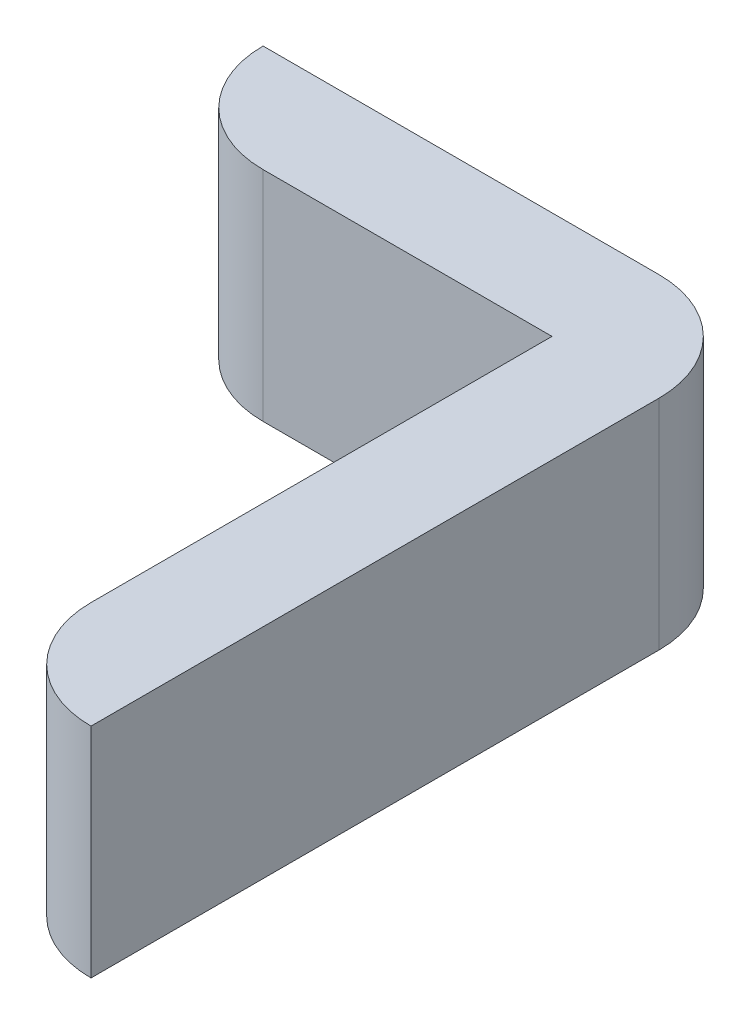
ISO-10303-21;
HEADER;
FILE_DESCRIPTION(('STEP AP214'),'2;1');
FILE_NAME('part.step','',(''),(''),'','','');
FILE_SCHEMA(('AUTOMOTIVE_DESIGN { 1 0 10303 214 1 1 1 1 }'));
ENDSEC;
DATA;
#1=APPLICATION_CONTEXT('core data for automotive mechanical design processes');
#2=APPLICATION_PROTOCOL_DEFINITION('international standard','automotive_design',2000,#1);
#3=PRODUCT_CONTEXT('',#1,'mechanical');
#4=PRODUCT('Part','Part','',(#3));
#5=PRODUCT_RELATED_PRODUCT_CATEGORY('part','',(#4));
#6=PRODUCT_DEFINITION_FORMATION('','',#4);
#7=PRODUCT_DEFINITION_CONTEXT('part definition',#1,'design');
#8=PRODUCT_DEFINITION('design','',#6,#7);
#9=PRODUCT_DEFINITION_SHAPE('','',#8);
#10=(LENGTH_UNIT() NAMED_UNIT(*) SI_UNIT(.MILLI.,.METRE.));
#11=(NAMED_UNIT(*) PLANE_ANGLE_UNIT() SI_UNIT($,.RADIAN.));
#12=(NAMED_UNIT(*) SI_UNIT($,.STERADIAN.) SOLID_ANGLE_UNIT());
#13=UNCERTAINTY_MEASURE_WITH_UNIT(LENGTH_MEASURE(1.E-05),#10,'distance_accuracy_value','');
#14=(GEOMETRIC_REPRESENTATION_CONTEXT(3) GLOBAL_UNCERTAINTY_ASSIGNED_CONTEXT((#13)) GLOBAL_UNIT_ASSIGNED_CONTEXT((#10,
#11,#12)) REPRESENTATION_CONTEXT('',''));
#15=CARTESIAN_POINT('',(0.,0.,0.));
#16=DIRECTION('',(0.,0.,1.));
#17=DIRECTION('',(1.,0.,0.));
#18=AXIS2_PLACEMENT_3D('',#15,#16,#17);
#19=CARTESIAN_POINT('',(-0.125,4.0648,0.));
#20=DIRECTION('',(0.,-1.,0.));
#21=DIRECTION('',(0.,0.,-1.));
#22=AXIS2_PLACEMENT_3D('',#19,#20,#21);
#23=PLANE('',#22);
#24=DIRECTION('',(-1.,0.,0.));
#25=VECTOR('',#24,1.);
#26=CARTESIAN_POINT('',(0.125,4.0648,0.25));
#27=LINE('',#26,#25);
#28=CARTESIAN_POINT('',(0.125,4.0648,0.25));
#29=VERTEX_POINT('',#28);
#30=CARTESIAN_POINT('',(0.8,4.0648,0.25));
#31=VERTEX_POINT('',#30);
#32=EDGE_CURVE('E102',#29,#31,#27,.F.);
#33=ORIENTED_EDGE('',*,*,#32,.T.);
#34=DIRECTION('',(0.,0.,-1.));
#35=VECTOR('',#34,1.);
#36=CARTESIAN_POINT('',(0.8,4.0648,0.25));
#37=LINE('',#36,#35);
#38=CARTESIAN_POINT('',(0.8,4.0648,1.327));
#39=VERTEX_POINT('',#38);
#40=EDGE_CURVE('E108',#31,#39,#37,.F.);
#41=ORIENTED_EDGE('',*,*,#40,.T.);
#42=CARTESIAN_POINT('',(1.05,4.0648,1.327));
#43=DIRECTION('',(0.,-1.,0.));
#44=DIRECTION('',(0.,0.,-1.));
#45=AXIS2_PLACEMENT_3D('',#42,#43,#44);
#46=CIRCLE('',#45,0.25);
#47=CARTESIAN_POINT('',(1.05,4.0648,1.577));
#48=VERTEX_POINT('',#47);
#49=EDGE_CURVE('E80',#48,#39,#46,.T.);
#50=ORIENTED_EDGE('',*,*,#49,.F.);
#51=DIRECTION('',(0.,0.,1.));
#52=VECTOR('',#51,1.);
#53=CARTESIAN_POINT('',(1.05,4.0648,1.577));
#54=LINE('',#53,#52);
#55=CARTESIAN_POINT('',(1.05,4.0648,0.25));
#56=VERTEX_POINT('',#55);
#57=EDGE_CURVE('E75',#48,#56,#54,.F.);
#58=ORIENTED_EDGE('',*,*,#57,.T.);
#59=CARTESIAN_POINT('',(0.8,4.0648,0.25));
#60=DIRECTION('',(0.,-1.,0.));
#61=DIRECTION('',(0.,0.,-1.));
#62=AXIS2_PLACEMENT_3D('',#59,#60,#61);
#63=CIRCLE('',#62,0.25);
#64=CARTESIAN_POINT('',(0.8,4.0648,0.));
#65=VERTEX_POINT('',#64);
#66=EDGE_CURVE('E19',#65,#56,#63,.T.);
#67=ORIENTED_EDGE('',*,*,#66,.F.);
#68=DIRECTION('',(1.,0.,0.));
#69=VECTOR('',#68,1.);
#70=CARTESIAN_POINT('',(0.8,4.0648,0.));
#71=LINE('',#70,#69);
#72=CARTESIAN_POINT('',(-0.125,4.0648,0.));
#73=VERTEX_POINT('',#72);
#74=EDGE_CURVE('E70',#65,#73,#71,.F.);
#75=ORIENTED_EDGE('',*,*,#74,.T.);
#76=CARTESIAN_POINT('',(0.125,4.0648,0.));
#77=DIRECTION('',(0.,-1.,0.));
#78=DIRECTION('',(0.,0.,-1.));
#79=AXIS2_PLACEMENT_3D('',#76,#77,#78);
#80=CIRCLE('',#79,0.25);
#81=EDGE_CURVE('E121',#29,#73,#80,.T.);
#82=ORIENTED_EDGE('',*,*,#81,.F.);
#83=EDGE_LOOP('',(#33,#41,#50,#58,#67,#75,#82));
#84=FACE_BOUND('',#83,.T.);
#85=ADVANCED_FACE('F16',(#84),#23,.F.);
#86=CARTESIAN_POINT('',(0.8,3.5552,0.));
#87=DIRECTION('',(0.,0.,1.));
#88=DIRECTION('',(1.,0.,0.));
#89=AXIS2_PLACEMENT_3D('',#86,#87,#88);
#90=PLANE('',#89);
#91=DIRECTION('',(0.,-1.,0.));
#92=VECTOR('',#91,1.);
#93=CARTESIAN_POINT('',(-0.125,3.5552,0.));
#94=LINE('',#93,#92);
#95=CARTESIAN_POINT('',(-0.125,3.5552,0.));
#96=VERTEX_POINT('',#95);
#97=EDGE_CURVE('E123',#73,#96,#94,.T.);
#98=ORIENTED_EDGE('',*,*,#97,.F.);
#99=ORIENTED_EDGE('',*,*,#74,.F.);
#100=DIRECTION('',(0.,-1.,0.));
#101=VECTOR('',#100,1.);
#102=CARTESIAN_POINT('',(0.8,3.5552,0.));
#103=LINE('',#102,#101);
#104=CARTESIAN_POINT('',(0.8,3.5552,0.));
#105=VERTEX_POINT('',#104);
#106=EDGE_CURVE('E92',#105,#65,#103,.F.);
#107=ORIENTED_EDGE('',*,*,#106,.F.);
#108=DIRECTION('',(1.,0.,0.));
#109=VECTOR('',#108,1.);
#110=CARTESIAN_POINT('',(-0.125,3.5552,0.));
#111=LINE('',#110,#109);
#112=EDGE_CURVE('E120',#96,#105,#111,.T.);
#113=ORIENTED_EDGE('',*,*,#112,.F.);
#114=EDGE_LOOP('',(#98,#99,#107,#113));
#115=FACE_BOUND('',#114,.T.);
#116=ADVANCED_FACE('F158',(#115),#90,.F.);
#117=CARTESIAN_POINT('',(0.8,3.5552,0.25));
#118=DIRECTION('',(0.,-1.,0.));
#119=DIRECTION('',(0.,0.,-1.));
#120=AXIS2_PLACEMENT_3D('',#117,#118,#119);
#121=CYLINDRICAL_SURFACE('',#120,0.25);
#122=ORIENTED_EDGE('',*,*,#66,.T.);
#123=DIRECTION('',(0.,1.,0.));
#124=VECTOR('',#123,1.);
#125=CARTESIAN_POINT('',(1.05,3.5552,0.25));
#126=LINE('',#125,#124);
#127=CARTESIAN_POINT('',(1.05,3.5552,0.25));
#128=VERTEX_POINT('',#127);
#129=EDGE_CURVE('E86',#56,#128,#126,.F.);
#130=ORIENTED_EDGE('',*,*,#129,.T.);
#131=CARTESIAN_POINT('',(0.8,3.5552,0.25));
#132=DIRECTION('',(0.,-1.,0.));
#133=DIRECTION('',(0.,0.,-1.));
#134=AXIS2_PLACEMENT_3D('',#131,#132,#133);
#135=CIRCLE('',#134,0.25);
#136=EDGE_CURVE('E118',#105,#128,#135,.T.);
#137=ORIENTED_EDGE('',*,*,#136,.F.);
#138=ORIENTED_EDGE('',*,*,#106,.T.);
#139=EDGE_LOOP('',(#122,#130,#137,#138));
#140=FACE_BOUND('',#139,.T.);
#141=ADVANCED_FACE('F89',(#140),#121,.T.);
#142=CARTESIAN_POINT('',(1.05,3.5552,1.577));
#143=DIRECTION('',(-1.,0.,0.));
#144=DIRECTION('',(0.,0.,1.));
#145=AXIS2_PLACEMENT_3D('',#142,#143,#144);
#146=PLANE('',#145);
#147=DIRECTION('',(0.,-1.,0.));
#148=VECTOR('',#147,1.);
#149=CARTESIAN_POINT('',(1.05,3.5552,1.577));
#150=LINE('',#149,#148);
#151=CARTESIAN_POINT('',(1.05,3.5552,1.577));
#152=VERTEX_POINT('',#151);
#153=EDGE_CURVE('E85',#152,#48,#150,.F.);
#154=ORIENTED_EDGE('',*,*,#153,.F.);
#155=DIRECTION('',(0.,0.,-1.));
#156=VECTOR('',#155,1.);
#157=CARTESIAN_POINT('',(1.05,3.5552,0.));
#158=LINE('',#157,#156);
#159=EDGE_CURVE('E94',#128,#152,#158,.F.);
#160=ORIENTED_EDGE('',*,*,#159,.F.);
#161=ORIENTED_EDGE('',*,*,#129,.F.);
#162=ORIENTED_EDGE('',*,*,#57,.F.);
#163=EDGE_LOOP('',(#154,#160,#161,#162));
#164=FACE_BOUND('',#163,.T.);
#165=ADVANCED_FACE('F93',(#164),#146,.F.);
#166=CARTESIAN_POINT('',(1.05,3.5552,1.327));
#167=DIRECTION('',(0.,-1.,0.));
#168=DIRECTION('',(0.,0.,-1.));
#169=AXIS2_PLACEMENT_3D('',#166,#167,#168);
#170=CYLINDRICAL_SURFACE('',#169,0.25);
#171=ORIENTED_EDGE('',*,*,#49,.T.);
#172=DIRECTION('',(0.,1.,0.));
#173=VECTOR('',#172,1.);
#174=CARTESIAN_POINT('',(0.8,3.5552,1.327));
#175=LINE('',#174,#173);
#176=CARTESIAN_POINT('',(0.8,3.5552,1.327));
#177=VERTEX_POINT('',#176);
#178=EDGE_CURVE('E105',#39,#177,#175,.F.);
#179=ORIENTED_EDGE('',*,*,#178,.T.);
#180=CARTESIAN_POINT('',(1.05,3.5552,1.327));
#181=DIRECTION('',(0.,-1.,0.));
#182=DIRECTION('',(0.,0.,-1.));
#183=AXIS2_PLACEMENT_3D('',#180,#181,#182);
#184=CIRCLE('',#183,0.25);
#185=EDGE_CURVE('E114',#152,#177,#184,.T.);
#186=ORIENTED_EDGE('',*,*,#185,.F.);
#187=ORIENTED_EDGE('',*,*,#153,.T.);
#188=EDGE_LOOP('',(#171,#179,#186,#187));
#189=FACE_BOUND('',#188,.T.);
#190=ADVANCED_FACE('F127',(#189),#170,.T.);
#191=CARTESIAN_POINT('',(0.8,3.5552,0.25));
#192=DIRECTION('',(1.,0.,0.));
#193=DIRECTION('',(0.,0.,-1.));
#194=AXIS2_PLACEMENT_3D('',#191,#192,#193);
#195=PLANE('',#194);
#196=ORIENTED_EDGE('',*,*,#178,.F.);
#197=ORIENTED_EDGE('',*,*,#40,.F.);
#198=DIRECTION('',(0.,1.,0.));
#199=VECTOR('',#198,1.);
#200=CARTESIAN_POINT('',(0.8,3.5552,0.25));
#201=LINE('',#200,#199);
#202=CARTESIAN_POINT('',(0.8,3.5552,0.25));
#203=VERTEX_POINT('',#202);
#204=EDGE_CURVE('E104',#31,#203,#201,.F.);
#205=ORIENTED_EDGE('',*,*,#204,.T.);
#206=DIRECTION('',(0.,0.,-1.));
#207=VECTOR('',#206,1.);
#208=CARTESIAN_POINT('',(0.8,3.5552,0.));
#209=LINE('',#208,#207);
#210=EDGE_CURVE('E117',#177,#203,#209,.T.);
#211=ORIENTED_EDGE('',*,*,#210,.F.);
#212=EDGE_LOOP('',(#196,#197,#205,#211));
#213=FACE_BOUND('',#212,.T.);
#214=ADVANCED_FACE('F150',(#213),#195,.F.);
#215=CARTESIAN_POINT('',(0.125,3.5552,0.25));
#216=DIRECTION('',(0.,0.,-1.));
#217=DIRECTION('',(-1.,0.,0.));
#218=AXIS2_PLACEMENT_3D('',#215,#216,#217);
#219=PLANE('',#218);
#220=ORIENTED_EDGE('',*,*,#204,.F.);
#221=ORIENTED_EDGE('',*,*,#32,.F.);
#222=DIRECTION('',(0.,-1.,0.));
#223=VECTOR('',#222,1.);
#224=CARTESIAN_POINT('',(0.125,3.5552,0.25));
#225=LINE('',#224,#223);
#226=CARTESIAN_POINT('',(0.125,3.5552,0.25));
#227=VERTEX_POINT('',#226);
#228=EDGE_CURVE('E34',#227,#29,#225,.F.);
#229=ORIENTED_EDGE('',*,*,#228,.F.);
#230=DIRECTION('',(1.,0.,0.));
#231=VECTOR('',#230,1.);
#232=CARTESIAN_POINT('',(-0.125,3.5552,0.25));
#233=LINE('',#232,#231);
#234=EDGE_CURVE('E25',#203,#227,#233,.F.);
#235=ORIENTED_EDGE('',*,*,#234,.F.);
#236=EDGE_LOOP('',(#220,#221,#229,#235));
#237=FACE_BOUND('',#236,.T.);
#238=ADVANCED_FACE('F151',(#237),#219,.F.);
#239=CARTESIAN_POINT('',(0.125,3.5552,0.));
#240=DIRECTION('',(0.,-1.,0.));
#241=DIRECTION('',(0.,0.,-1.));
#242=AXIS2_PLACEMENT_3D('',#239,#240,#241);
#243=CYLINDRICAL_SURFACE('',#242,0.25);
#244=ORIENTED_EDGE('',*,*,#81,.T.);
#245=ORIENTED_EDGE('',*,*,#97,.T.);
#246=CARTESIAN_POINT('',(0.125,3.5552,0.));
#247=DIRECTION('',(0.,-1.,0.));
#248=DIRECTION('',(0.,0.,-1.));
#249=AXIS2_PLACEMENT_3D('',#246,#247,#248);
#250=CIRCLE('',#249,0.25);
#251=EDGE_CURVE('E11',#227,#96,#250,.T.);
#252=ORIENTED_EDGE('',*,*,#251,.F.);
#253=ORIENTED_EDGE('',*,*,#228,.T.);
#254=EDGE_LOOP('',(#244,#245,#252,#253));
#255=FACE_BOUND('',#254,.T.);
#256=ADVANCED_FACE('F156',(#255),#243,.T.);
#257=CARTESIAN_POINT('',(-0.125,3.5552,0.));
#258=DIRECTION('',(0.,-1.,0.));
#259=DIRECTION('',(0.,0.,-1.));
#260=AXIS2_PLACEMENT_3D('',#257,#258,#259);
#261=PLANE('',#260);
#262=ORIENTED_EDGE('',*,*,#234,.T.);
#263=ORIENTED_EDGE('',*,*,#251,.T.);
#264=ORIENTED_EDGE('',*,*,#112,.T.);
#265=ORIENTED_EDGE('',*,*,#136,.T.);
#266=ORIENTED_EDGE('',*,*,#159,.T.);
#267=ORIENTED_EDGE('',*,*,#185,.T.);
#268=ORIENTED_EDGE('',*,*,#210,.T.);
#269=EDGE_LOOP('',(#262,#263,#264,#265,#266,#267,#268));
#270=FACE_BOUND('',#269,.T.);
#271=ADVANCED_FACE('F132',(#270),#261,.T.);
#272=CLOSED_SHELL('',(#85,#116,#141,#165,#190,#214,#238,#256,#271));
#273=MANIFOLD_SOLID_BREP('B1',#272);
#274=ADVANCED_BREP_SHAPE_REPRESENTATION('',(#18,#273),#14);
#275=SHAPE_DEFINITION_REPRESENTATION(#9,#274);
ENDSEC;
END-ISO-10303-21;
